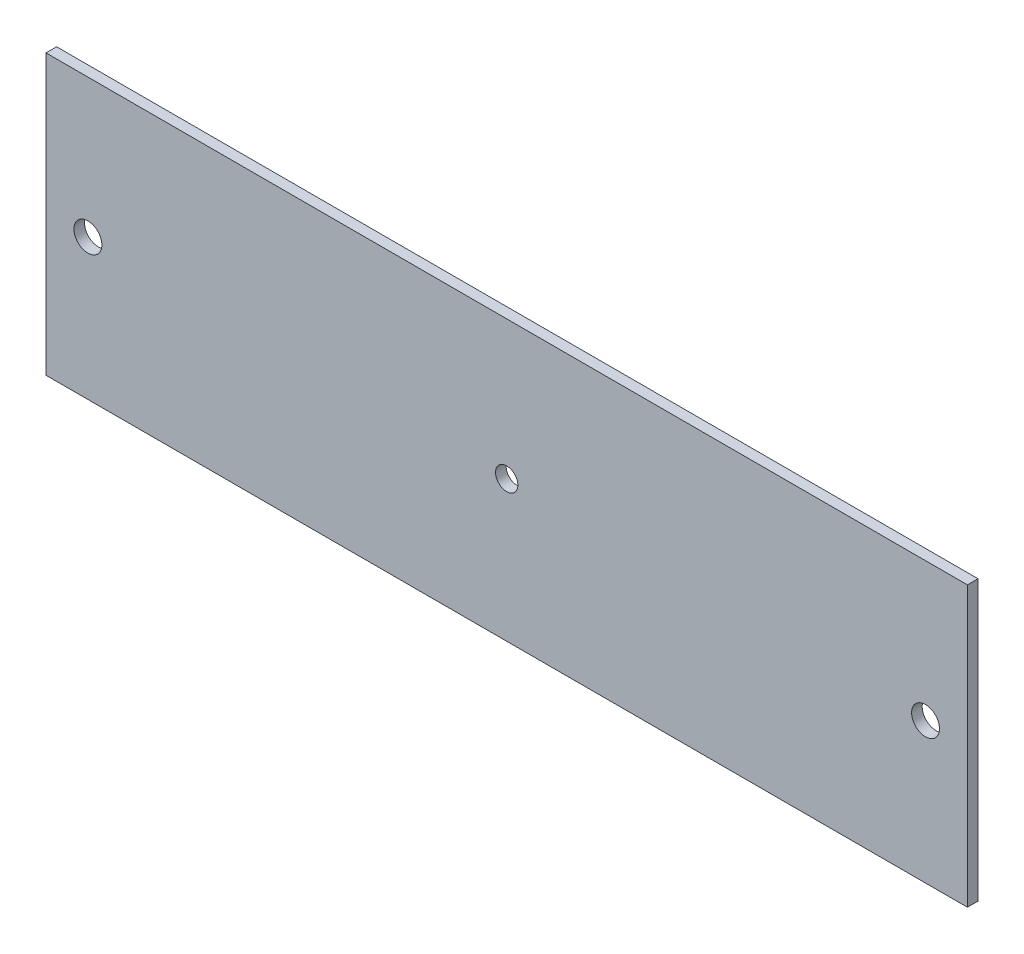
ISO-10303-21;
HEADER;
FILE_DESCRIPTION(('STEP AP214'),'2;1');
FILE_NAME('part.step','',(''),(''),'','','');
FILE_SCHEMA(('AUTOMOTIVE_DESIGN { 1 0 10303 214 1 1 1 1 }'));
ENDSEC;
DATA;
#1=APPLICATION_CONTEXT('core data for automotive mechanical design processes');
#2=APPLICATION_PROTOCOL_DEFINITION('international standard','automotive_design',2000,#1);
#3=PRODUCT_CONTEXT('',#1,'mechanical');
#4=PRODUCT('Part','Part','',(#3));
#5=PRODUCT_RELATED_PRODUCT_CATEGORY('part','',(#4));
#6=PRODUCT_DEFINITION_FORMATION('','',#4);
#7=PRODUCT_DEFINITION_CONTEXT('part definition',#1,'design');
#8=PRODUCT_DEFINITION('design','',#6,#7);
#9=PRODUCT_DEFINITION_SHAPE('','',#8);
#10=(LENGTH_UNIT() NAMED_UNIT(*) SI_UNIT(.MILLI.,.METRE.));
#11=(NAMED_UNIT(*) PLANE_ANGLE_UNIT() SI_UNIT($,.RADIAN.));
#12=(NAMED_UNIT(*) SI_UNIT($,.STERADIAN.) SOLID_ANGLE_UNIT());
#13=UNCERTAINTY_MEASURE_WITH_UNIT(LENGTH_MEASURE(1.E-05),#10,'distance_accuracy_value','');
#14=(GEOMETRIC_REPRESENTATION_CONTEXT(3) GLOBAL_UNCERTAINTY_ASSIGNED_CONTEXT((#13)) GLOBAL_UNIT_ASSIGNED_CONTEXT((#10,
#11,#12)) REPRESENTATION_CONTEXT('',''));
#15=CARTESIAN_POINT('',(0.,0.,0.));
#16=DIRECTION('',(0.,0.,1.));
#17=DIRECTION('',(1.,0.,0.));
#18=AXIS2_PLACEMENT_3D('',#15,#16,#17);
#19=CARTESIAN_POINT('',(-35.4064268005116,34.3768339263956,-1.89738));
#20=DIRECTION('',(-1.,0.,0.));
#21=DIRECTION('',(0.,-1.,0.));
#22=AXIS2_PLACEMENT_3D('',#19,#20,#21);
#23=PLANE('',#22);
#24=DIRECTION('',(0.,-1.,0.));
#25=VECTOR('',#24,1.);
#26=CARTESIAN_POINT('',(-35.4064268005116,34.3768339263956,0.));
#27=LINE('',#26,#25);
#28=CARTESIAN_POINT('',(-35.4064268005116,34.3768339263956,0.));
#29=VERTEX_POINT('',#28);
#30=CARTESIAN_POINT('',(-35.4064268005116,-15.6231660736044,0.));
#31=VERTEX_POINT('',#30);
#32=EDGE_CURVE('E102',#29,#31,#27,.T.);
#33=ORIENTED_EDGE('',*,*,#32,.F.);
#34=DIRECTION('',(0.,0.,1.));
#35=VECTOR('',#34,1.);
#36=CARTESIAN_POINT('',(-35.4064268005116,34.3768339263956,-1.89738));
#37=LINE('',#36,#35);
#38=CARTESIAN_POINT('',(-35.4064268005116,34.3768339263956,-1.89738));
#39=VERTEX_POINT('',#38);
#40=EDGE_CURVE('E11',#39,#29,#37,.T.);
#41=ORIENTED_EDGE('',*,*,#40,.F.);
#42=DIRECTION('',(0.,-1.,0.));
#43=VECTOR('',#42,1.);
#44=CARTESIAN_POINT('',(-35.4064268005116,34.3768339263956,-1.89738));
#45=LINE('',#44,#43);
#46=CARTESIAN_POINT('',(-35.4064268005116,-15.6231660736044,-1.89738));
#47=VERTEX_POINT('',#46);
#48=EDGE_CURVE('E95',#39,#47,#45,.T.);
#49=ORIENTED_EDGE('',*,*,#48,.T.);
#50=DIRECTION('',(0.,0.,1.));
#51=VECTOR('',#50,1.);
#52=CARTESIAN_POINT('',(-35.4064268005116,-15.6231660736044,-1.89738));
#53=LINE('',#52,#51);
#54=EDGE_CURVE('E78',#47,#31,#53,.T.);
#55=ORIENTED_EDGE('',*,*,#54,.T.);
#56=EDGE_LOOP('',(#33,#41,#49,#55));
#57=FACE_BOUND('',#56,.T.);
#58=ADVANCED_FACE('F35',(#57),#23,.T.);
#59=CARTESIAN_POINT('',(-35.4064268005116,34.3768339263956,-1.89738));
#60=DIRECTION('',(0.,1.,0.));
#61=DIRECTION('',(0.,0.,1.));
#62=AXIS2_PLACEMENT_3D('',#59,#60,#61);
#63=PLANE('',#62);
#64=DIRECTION('',(-1.,0.,0.));
#65=VECTOR('',#64,1.);
#66=CARTESIAN_POINT('',(-35.4064268005116,34.3768339263956,0.));
#67=LINE('',#66,#65);
#68=CARTESIAN_POINT('',(129.593573199488,34.3768339263956,0.));
#69=VERTEX_POINT('',#68);
#70=EDGE_CURVE('E97',#69,#29,#67,.T.);
#71=ORIENTED_EDGE('',*,*,#70,.F.);
#72=DIRECTION('',(0.,0.,1.));
#73=VECTOR('',#72,1.);
#74=CARTESIAN_POINT('',(129.593573199488,34.3768339263956,-1.89738));
#75=LINE('',#74,#73);
#76=CARTESIAN_POINT('',(129.593573199488,34.3768339263956,-1.89738));
#77=VERTEX_POINT('',#76);
#78=EDGE_CURVE('E44',#77,#69,#75,.T.);
#79=ORIENTED_EDGE('',*,*,#78,.F.);
#80=DIRECTION('',(-1.,0.,0.));
#81=VECTOR('',#80,1.);
#82=CARTESIAN_POINT('',(-35.4064268005116,34.3768339263956,-1.89738));
#83=LINE('',#82,#81);
#84=EDGE_CURVE('E92',#77,#39,#83,.T.);
#85=ORIENTED_EDGE('',*,*,#84,.T.);
#86=ORIENTED_EDGE('',*,*,#40,.T.);
#87=EDGE_LOOP('',(#71,#79,#85,#86));
#88=FACE_BOUND('',#87,.T.);
#89=ADVANCED_FACE('F153',(#88),#63,.T.);
#90=CARTESIAN_POINT('',(129.593573199488,34.3768339263956,-1.89738));
#91=DIRECTION('',(1.,0.,0.));
#92=DIRECTION('',(0.,0.,-1.));
#93=AXIS2_PLACEMENT_3D('',#90,#91,#92);
#94=PLANE('',#93);
#95=DIRECTION('',(0.,1.,0.));
#96=VECTOR('',#95,1.);
#97=CARTESIAN_POINT('',(129.593573199488,34.3768339263956,0.));
#98=LINE('',#97,#96);
#99=CARTESIAN_POINT('',(129.593573199488,-15.6231660736044,0.));
#100=VERTEX_POINT('',#99);
#101=EDGE_CURVE('E86',#100,#69,#98,.T.);
#102=ORIENTED_EDGE('',*,*,#101,.F.);
#103=DIRECTION('',(0.,0.,1.));
#104=VECTOR('',#103,1.);
#105=CARTESIAN_POINT('',(129.593573199488,-15.6231660736044,-1.89738));
#106=LINE('',#105,#104);
#107=CARTESIAN_POINT('',(129.593573199488,-15.6231660736044,-1.89738));
#108=VERTEX_POINT('',#107);
#109=EDGE_CURVE('E81',#108,#100,#106,.T.);
#110=ORIENTED_EDGE('',*,*,#109,.F.);
#111=DIRECTION('',(0.,1.,0.));
#112=VECTOR('',#111,1.);
#113=CARTESIAN_POINT('',(129.593573199488,34.3768339263956,-1.89738));
#114=LINE('',#113,#112);
#115=EDGE_CURVE('E84',#108,#77,#114,.T.);
#116=ORIENTED_EDGE('',*,*,#115,.T.);
#117=ORIENTED_EDGE('',*,*,#78,.T.);
#118=EDGE_LOOP('',(#102,#110,#116,#117));
#119=FACE_BOUND('',#118,.T.);
#120=ADVANCED_FACE('F83',(#119),#94,.T.);
#121=CARTESIAN_POINT('',(-35.4064268005116,-15.6231660736044,-1.89738));
#122=DIRECTION('',(0.,-1.,0.));
#123=DIRECTION('',(0.,0.,-1.));
#124=AXIS2_PLACEMENT_3D('',#121,#122,#123);
#125=PLANE('',#124);
#126=DIRECTION('',(1.,0.,0.));
#127=VECTOR('',#126,1.);
#128=CARTESIAN_POINT('',(-35.4064268005116,-15.6231660736044,0.));
#129=LINE('',#128,#127);
#130=EDGE_CURVE('E105',#31,#100,#129,.T.);
#131=ORIENTED_EDGE('',*,*,#130,.F.);
#132=ORIENTED_EDGE('',*,*,#54,.F.);
#133=DIRECTION('',(1.,0.,0.));
#134=VECTOR('',#133,1.);
#135=CARTESIAN_POINT('',(-35.4064268005116,-15.6231660736044,-1.89738));
#136=LINE('',#135,#134);
#137=EDGE_CURVE('E91',#47,#108,#136,.T.);
#138=ORIENTED_EDGE('',*,*,#137,.T.);
#139=ORIENTED_EDGE('',*,*,#109,.T.);
#140=EDGE_LOOP('',(#131,#132,#138,#139));
#141=FACE_BOUND('',#140,.T.);
#142=ADVANCED_FACE('F94',(#141),#125,.T.);
#143=CARTESIAN_POINT('',(0.,0.,-1.89738));
#144=DIRECTION('',(0.,0.,1.));
#145=DIRECTION('',(1.,0.,0.));
#146=AXIS2_PLACEMENT_3D('',#143,#144,#145);
#147=PLANE('',#146);
#148=CARTESIAN_POINT('',(47.0935731994884,9.57146206669179,-1.89738));
#149=DIRECTION('',(0.,0.,-1.));
#150=DIRECTION('',(-1.,0.,0.));
#151=AXIS2_PLACEMENT_3D('',#148,#149,#150);
#152=CIRCLE('',#151,2.);
#153=CARTESIAN_POINT('',(45.0935731994884,9.57146206669179,-1.89738));
#154=VERTEX_POINT('',#153);
#155=EDGE_CURVE('E126',#154,#154,#152,.T.);
#156=ORIENTED_EDGE('',*,*,#155,.F.);
#157=EDGE_LOOP('',(#156));
#158=FACE_BOUND('',#157,.T.);
#159=CARTESIAN_POINT('',(-27.9064268005116,9.57146206669116,-1.89738));
#160=DIRECTION('',(0.,0.,-1.));
#161=DIRECTION('',(-1.,0.,0.));
#162=AXIS2_PLACEMENT_3D('',#159,#160,#161);
#163=CIRCLE('',#162,2.5);
#164=CARTESIAN_POINT('',(-30.4064268005116,9.57146206669116,-1.89738));
#165=VERTEX_POINT('',#164);
#166=EDGE_CURVE('E117',#165,#165,#163,.T.);
#167=ORIENTED_EDGE('',*,*,#166,.F.);
#168=EDGE_LOOP('',(#167));
#169=FACE_BOUND('',#168,.T.);
#170=CARTESIAN_POINT('',(122.0957759591,9.55859349842749,-1.89738));
#171=DIRECTION('',(0.,0.,-1.));
#172=DIRECTION('',(-1.,0.,0.));
#173=AXIS2_PLACEMENT_3D('',#170,#171,#172);
#174=CIRCLE('',#173,2.5);
#175=CARTESIAN_POINT('',(119.5957759591,9.55859349842749,-1.89738));
#176=VERTEX_POINT('',#175);
#177=EDGE_CURVE('E114',#176,#176,#174,.T.);
#178=ORIENTED_EDGE('',*,*,#177,.F.);
#179=EDGE_LOOP('',(#178));
#180=FACE_BOUND('',#179,.T.);
#181=ORIENTED_EDGE('',*,*,#48,.F.);
#182=ORIENTED_EDGE('',*,*,#84,.F.);
#183=ORIENTED_EDGE('',*,*,#115,.F.);
#184=ORIENTED_EDGE('',*,*,#137,.F.);
#185=EDGE_LOOP('',(#181,#182,#183,#184));
#186=FACE_BOUND('',#185,.T.);
#187=ADVANCED_FACE('F90',(#158,#169,#180,#186),#147,.F.);
#188=CARTESIAN_POINT('',(0.,0.,0.));
#189=DIRECTION('',(0.,0.,1.));
#190=DIRECTION('',(1.,0.,0.));
#191=AXIS2_PLACEMENT_3D('',#188,#189,#190);
#192=PLANE('',#191);
#193=CARTESIAN_POINT('',(47.0935731994884,9.57146206669179,0.));
#194=DIRECTION('',(0.,0.,1.));
#195=DIRECTION('',(1.,0.,0.));
#196=AXIS2_PLACEMENT_3D('',#193,#194,#195);
#197=CIRCLE('',#196,2.);
#198=CARTESIAN_POINT('',(49.0935731994884,9.57146206669179,0.));
#199=VERTEX_POINT('',#198);
#200=EDGE_CURVE('E38',#199,#199,#197,.T.);
#201=ORIENTED_EDGE('',*,*,#200,.F.);
#202=EDGE_LOOP('',(#201));
#203=FACE_BOUND('',#202,.T.);
#204=CARTESIAN_POINT('',(-27.9064268005116,9.57146206669116,0.));
#205=DIRECTION('',(0.,0.,1.));
#206=DIRECTION('',(1.,0.,0.));
#207=AXIS2_PLACEMENT_3D('',#204,#205,#206);
#208=CIRCLE('',#207,2.5);
#209=CARTESIAN_POINT('',(-25.4064268005116,9.57146206669116,0.));
#210=VERTEX_POINT('',#209);
#211=EDGE_CURVE('E115',#210,#210,#208,.T.);
#212=ORIENTED_EDGE('',*,*,#211,.F.);
#213=EDGE_LOOP('',(#212));
#214=FACE_BOUND('',#213,.T.);
#215=CARTESIAN_POINT('',(122.0957759591,9.55859349842749,0.));
#216=DIRECTION('',(0.,0.,1.));
#217=DIRECTION('',(1.,0.,0.));
#218=AXIS2_PLACEMENT_3D('',#215,#216,#217);
#219=CIRCLE('',#218,2.5);
#220=CARTESIAN_POINT('',(124.5957759591,9.55859349842749,0.));
#221=VERTEX_POINT('',#220);
#222=EDGE_CURVE('E106',#221,#221,#219,.T.);
#223=ORIENTED_EDGE('',*,*,#222,.F.);
#224=EDGE_LOOP('',(#223));
#225=FACE_BOUND('',#224,.T.);
#226=ORIENTED_EDGE('',*,*,#32,.T.);
#227=ORIENTED_EDGE('',*,*,#130,.T.);
#228=ORIENTED_EDGE('',*,*,#101,.T.);
#229=ORIENTED_EDGE('',*,*,#70,.T.);
#230=EDGE_LOOP('',(#226,#227,#228,#229));
#231=FACE_BOUND('',#230,.T.);
#232=ADVANCED_FACE('F135',(#203,#214,#225,#231),#192,.T.);
#233=CARTESIAN_POINT('',(122.0957759591,9.55859349842749,0.10262));
#234=DIRECTION('',(0.,0.,-1.));
#235=DIRECTION('',(-1.,0.,0.));
#236=AXIS2_PLACEMENT_3D('',#233,#234,#235);
#237=CYLINDRICAL_SURFACE('',#236,2.5);
#238=ORIENTED_EDGE('',*,*,#222,.T.);
#239=EDGE_LOOP('',(#238));
#240=FACE_BOUND('',#239,.T.);
#241=ORIENTED_EDGE('',*,*,#177,.T.);
#242=EDGE_LOOP('',(#241));
#243=FACE_BOUND('',#242,.T.);
#244=ADVANCED_FACE('F140',(#240,#243),#237,.F.);
#245=CARTESIAN_POINT('',(-27.9064268005116,9.57146206669116,0.10262));
#246=DIRECTION('',(0.,0.,-1.));
#247=DIRECTION('',(-1.,0.,0.));
#248=AXIS2_PLACEMENT_3D('',#245,#246,#247);
#249=CYLINDRICAL_SURFACE('',#248,2.5);
#250=ORIENTED_EDGE('',*,*,#211,.T.);
#251=EDGE_LOOP('',(#250));
#252=FACE_BOUND('',#251,.T.);
#253=ORIENTED_EDGE('',*,*,#166,.T.);
#254=EDGE_LOOP('',(#253));
#255=FACE_BOUND('',#254,.T.);
#256=ADVANCED_FACE('F142',(#252,#255),#249,.F.);
#257=CARTESIAN_POINT('',(47.0935731994884,9.57146206669179,0.10262));
#258=DIRECTION('',(0.,0.,-1.));
#259=DIRECTION('',(-1.,0.,0.));
#260=AXIS2_PLACEMENT_3D('',#257,#258,#259);
#261=CYLINDRICAL_SURFACE('',#260,2.);
#262=ORIENTED_EDGE('',*,*,#200,.T.);
#263=EDGE_LOOP('',(#262));
#264=FACE_BOUND('',#263,.T.);
#265=ORIENTED_EDGE('',*,*,#155,.T.);
#266=EDGE_LOOP('',(#265));
#267=FACE_BOUND('',#266,.T.);
#268=ADVANCED_FACE('F131',(#264,#267),#261,.F.);
#269=CLOSED_SHELL('',(#58,#89,#120,#142,#187,#232,#244,#256,#268));
#270=MANIFOLD_SOLID_BREP('B2',#269);
#271=ADVANCED_BREP_SHAPE_REPRESENTATION('',(#18,#270),#14);
#272=SHAPE_DEFINITION_REPRESENTATION(#9,#271);
ENDSEC;
END-ISO-10303-21;
